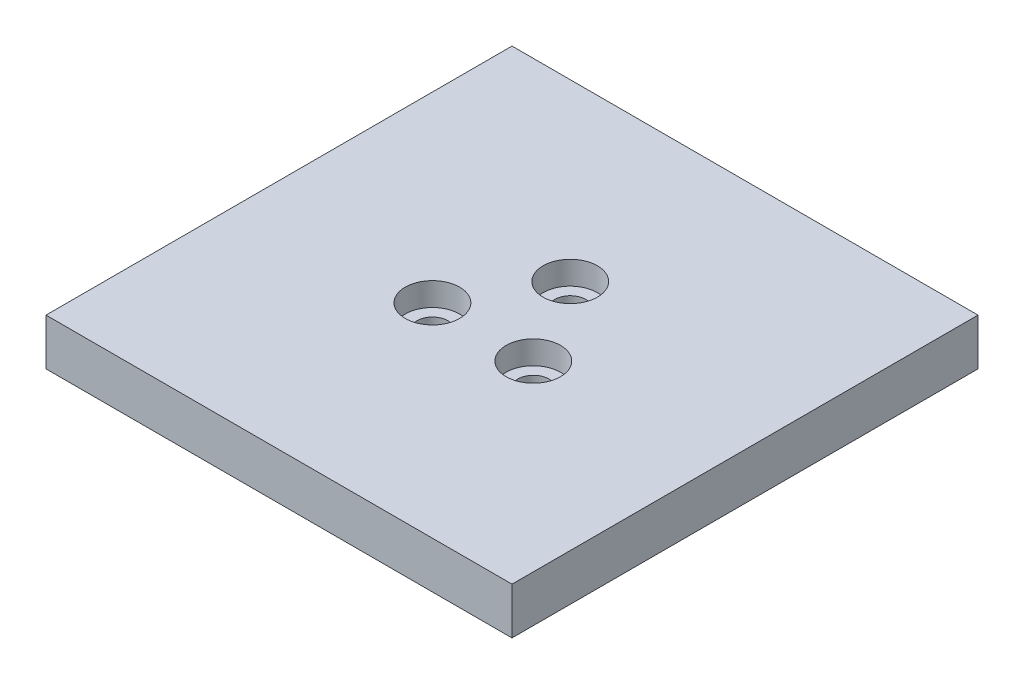
ISO-10303-21;
HEADER;
FILE_DESCRIPTION(('STEP AP214'),'2;1');
FILE_NAME('part.step','',(''),(''),'','','');
FILE_SCHEMA(('AUTOMOTIVE_DESIGN { 1 0 10303 214 1 1 1 1 }'));
ENDSEC;
DATA;
#1=APPLICATION_CONTEXT('core data for automotive mechanical design processes');
#2=APPLICATION_PROTOCOL_DEFINITION('international standard','automotive_design',2000,#1);
#3=PRODUCT_CONTEXT('',#1,'mechanical');
#4=PRODUCT('Part','Part','',(#3));
#5=PRODUCT_RELATED_PRODUCT_CATEGORY('part','',(#4));
#6=PRODUCT_DEFINITION_FORMATION('','',#4);
#7=PRODUCT_DEFINITION_CONTEXT('part definition',#1,'design');
#8=PRODUCT_DEFINITION('design','',#6,#7);
#9=PRODUCT_DEFINITION_SHAPE('','',#8);
#10=(LENGTH_UNIT() NAMED_UNIT(*) SI_UNIT(.MILLI.,.METRE.));
#11=(NAMED_UNIT(*) PLANE_ANGLE_UNIT() SI_UNIT($,.RADIAN.));
#12=(NAMED_UNIT(*) SI_UNIT($,.STERADIAN.) SOLID_ANGLE_UNIT());
#13=UNCERTAINTY_MEASURE_WITH_UNIT(LENGTH_MEASURE(1.E-05),#10,'distance_accuracy_value','');
#14=(GEOMETRIC_REPRESENTATION_CONTEXT(3) GLOBAL_UNCERTAINTY_ASSIGNED_CONTEXT((#13)) GLOBAL_UNIT_ASSIGNED_CONTEXT((#10,
#11,#12)) REPRESENTATION_CONTEXT('',''));
#15=CARTESIAN_POINT('',(0.,0.,0.));
#16=DIRECTION('',(0.,0.,1.));
#17=DIRECTION('',(1.,0.,0.));
#18=AXIS2_PLACEMENT_3D('',#15,#16,#17);
#19=CARTESIAN_POINT('',(-30.,6.,30.));
#20=DIRECTION('',(-1.,0.,0.));
#21=DIRECTION('',(0.,0.,1.));
#22=AXIS2_PLACEMENT_3D('',#19,#20,#21);
#23=PLANE('',#22);
#24=DIRECTION('',(0.,0.,-1.));
#25=VECTOR('',#24,1.);
#26=CARTESIAN_POINT('',(-30.,0.,30.));
#27=LINE('',#26,#25);
#28=CARTESIAN_POINT('',(-30.,0.,30.));
#29=VERTEX_POINT('',#28);
#30=CARTESIAN_POINT('',(-30.,0.,-30.));
#31=VERTEX_POINT('',#30);
#32=EDGE_CURVE('E101',#29,#31,#27,.T.);
#33=ORIENTED_EDGE('',*,*,#32,.F.);
#34=DIRECTION('',(0.,-1.,0.));
#35=VECTOR('',#34,1.);
#36=CARTESIAN_POINT('',(-30.,6.,30.));
#37=LINE('',#36,#35);
#38=CARTESIAN_POINT('',(-30.,6.,30.));
#39=VERTEX_POINT('',#38);
#40=EDGE_CURVE('E11',#39,#29,#37,.T.);
#41=ORIENTED_EDGE('',*,*,#40,.F.);
#42=DIRECTION('',(0.,0.,-1.));
#43=VECTOR('',#42,1.);
#44=CARTESIAN_POINT('',(-30.,6.,30.));
#45=LINE('',#44,#43);
#46=CARTESIAN_POINT('',(-30.,6.,-30.));
#47=VERTEX_POINT('',#46);
#48=EDGE_CURVE('E95',#39,#47,#45,.T.);
#49=ORIENTED_EDGE('',*,*,#48,.T.);
#50=DIRECTION('',(0.,-1.,0.));
#51=VECTOR('',#50,1.);
#52=CARTESIAN_POINT('',(-30.,6.,-30.));
#53=LINE('',#52,#51);
#54=EDGE_CURVE('E74',#47,#31,#53,.T.);
#55=ORIENTED_EDGE('',*,*,#54,.T.);
#56=EDGE_LOOP('',(#33,#41,#49,#55));
#57=FACE_BOUND('',#56,.T.);
#58=ADVANCED_FACE('F33',(#57),#23,.T.);
#59=CARTESIAN_POINT('',(-30.,6.,30.));
#60=DIRECTION('',(0.,0.,-1.));
#61=DIRECTION('',(-1.,0.,0.));
#62=AXIS2_PLACEMENT_3D('',#59,#60,#61);
#63=PLANE('',#62);
#64=DIRECTION('',(1.,0.,0.));
#65=VECTOR('',#64,1.);
#66=CARTESIAN_POINT('',(-30.,0.,30.));
#67=LINE('',#66,#65);
#68=CARTESIAN_POINT('',(30.,0.,30.));
#69=VERTEX_POINT('',#68);
#70=EDGE_CURVE('E66',#29,#69,#67,.T.);
#71=ORIENTED_EDGE('',*,*,#70,.T.);
#72=DIRECTION('',(0.,-1.,0.));
#73=VECTOR('',#72,1.);
#74=CARTESIAN_POINT('',(30.,6.,30.));
#75=LINE('',#74,#73);
#76=CARTESIAN_POINT('',(30.,6.,30.));
#77=VERTEX_POINT('',#76);
#78=EDGE_CURVE('E42',#77,#69,#75,.T.);
#79=ORIENTED_EDGE('',*,*,#78,.F.);
#80=DIRECTION('',(1.,0.,0.));
#81=VECTOR('',#80,1.);
#82=CARTESIAN_POINT('',(-30.,6.,30.));
#83=LINE('',#82,#81);
#84=EDGE_CURVE('E84',#39,#77,#83,.T.);
#85=ORIENTED_EDGE('',*,*,#84,.F.);
#86=ORIENTED_EDGE('',*,*,#40,.T.);
#87=EDGE_LOOP('',(#71,#79,#85,#86));
#88=FACE_BOUND('',#87,.T.);
#89=ADVANCED_FACE('F165',(#88),#63,.F.);
#90=CARTESIAN_POINT('',(30.,6.,30.));
#91=DIRECTION('',(-1.,0.,0.));
#92=DIRECTION('',(0.,0.,1.));
#93=AXIS2_PLACEMENT_3D('',#90,#91,#92);
#94=PLANE('',#93);
#95=DIRECTION('',(0.,0.,-1.));
#96=VECTOR('',#95,1.);
#97=CARTESIAN_POINT('',(30.,0.,30.));
#98=LINE('',#97,#96);
#99=CARTESIAN_POINT('',(30.,0.,-30.));
#100=VERTEX_POINT('',#99);
#101=EDGE_CURVE('E91',#69,#100,#98,.T.);
#102=ORIENTED_EDGE('',*,*,#101,.T.);
#103=DIRECTION('',(0.,-1.,0.));
#104=VECTOR('',#103,1.);
#105=CARTESIAN_POINT('',(30.,6.,-30.));
#106=LINE('',#105,#104);
#107=CARTESIAN_POINT('',(30.,6.,-30.));
#108=VERTEX_POINT('',#107);
#109=EDGE_CURVE('E88',#108,#100,#106,.T.);
#110=ORIENTED_EDGE('',*,*,#109,.F.);
#111=DIRECTION('',(0.,0.,-1.));
#112=VECTOR('',#111,1.);
#113=CARTESIAN_POINT('',(30.,6.,30.));
#114=LINE('',#113,#112);
#115=EDGE_CURVE('E79',#77,#108,#114,.T.);
#116=ORIENTED_EDGE('',*,*,#115,.F.);
#117=ORIENTED_EDGE('',*,*,#78,.T.);
#118=EDGE_LOOP('',(#102,#110,#116,#117));
#119=FACE_BOUND('',#118,.T.);
#120=ADVANCED_FACE('F89',(#119),#94,.F.);
#121=CARTESIAN_POINT('',(-30.,6.,-30.));
#122=DIRECTION('',(0.,0.,-1.));
#123=DIRECTION('',(-1.,0.,0.));
#124=AXIS2_PLACEMENT_3D('',#121,#122,#123);
#125=PLANE('',#124);
#126=DIRECTION('',(1.,0.,0.));
#127=VECTOR('',#126,1.);
#128=CARTESIAN_POINT('',(-30.,0.,-30.));
#129=LINE('',#128,#127);
#130=EDGE_CURVE('E104',#31,#100,#129,.T.);
#131=ORIENTED_EDGE('',*,*,#130,.F.);
#132=ORIENTED_EDGE('',*,*,#54,.F.);
#133=DIRECTION('',(1.,0.,0.));
#134=VECTOR('',#133,1.);
#135=CARTESIAN_POINT('',(-30.,6.,-30.));
#136=LINE('',#135,#134);
#137=EDGE_CURVE('E83',#47,#108,#136,.T.);
#138=ORIENTED_EDGE('',*,*,#137,.T.);
#139=ORIENTED_EDGE('',*,*,#109,.T.);
#140=EDGE_LOOP('',(#131,#132,#138,#139));
#141=FACE_BOUND('',#140,.T.);
#142=ADVANCED_FACE('F94',(#141),#125,.T.);
#143=CARTESIAN_POINT('',(0.,6.,0.));
#144=DIRECTION('',(0.,-1.,0.));
#145=DIRECTION('',(0.,0.,-1.));
#146=AXIS2_PLACEMENT_3D('',#143,#144,#145);
#147=PLANE('',#146);
#148=CARTESIAN_POINT('',(0.,6.,-7.5));
#149=DIRECTION('',(0.,-1.,0.));
#150=DIRECTION('',(0.,0.,-1.));
#151=AXIS2_PLACEMENT_3D('',#148,#149,#150);
#152=CIRCLE('',#151,3.5);
#153=CARTESIAN_POINT('',(0.,6.,-11.));
#154=VERTEX_POINT('',#153);
#155=EDGE_CURVE('E140',#154,#154,#152,.T.);
#156=ORIENTED_EDGE('',*,*,#155,.T.);
#157=EDGE_LOOP('',(#156));
#158=FACE_BOUND('',#157,.T.);
#159=CARTESIAN_POINT('',(6.49519052838328,6.,3.75000000000002));
#160=DIRECTION('',(0.,-1.,0.));
#161=DIRECTION('',(0.,0.,-1.));
#162=AXIS2_PLACEMENT_3D('',#159,#160,#161);
#163=CIRCLE('',#162,3.5);
#164=CARTESIAN_POINT('',(6.49519052838328,6.,0.250000000000024));
#165=VERTEX_POINT('',#164);
#166=EDGE_CURVE('E134',#165,#165,#163,.T.);
#167=ORIENTED_EDGE('',*,*,#166,.T.);
#168=EDGE_LOOP('',(#167));
#169=FACE_BOUND('',#168,.T.);
#170=CARTESIAN_POINT('',(-6.49519052838332,6.,3.74999999999995));
#171=DIRECTION('',(0.,-1.,0.));
#172=DIRECTION('',(0.,0.,-1.));
#173=AXIS2_PLACEMENT_3D('',#170,#171,#172);
#174=CIRCLE('',#173,3.5);
#175=CARTESIAN_POINT('',(-6.49519052838332,6.,0.249999999999949));
#176=VERTEX_POINT('',#175);
#177=EDGE_CURVE('E131',#176,#176,#174,.T.);
#178=ORIENTED_EDGE('',*,*,#177,.T.);
#179=EDGE_LOOP('',(#178));
#180=FACE_BOUND('',#179,.T.);
#181=ORIENTED_EDGE('',*,*,#48,.F.);
#182=ORIENTED_EDGE('',*,*,#84,.T.);
#183=ORIENTED_EDGE('',*,*,#115,.T.);
#184=ORIENTED_EDGE('',*,*,#137,.F.);
#185=EDGE_LOOP('',(#181,#182,#183,#184));
#186=FACE_BOUND('',#185,.T.);
#187=ADVANCED_FACE('F82',(#158,#169,#180,#186),#147,.F.);
#188=CARTESIAN_POINT('',(0.,0.,0.));
#189=DIRECTION('',(0.,-1.,0.));
#190=DIRECTION('',(0.,0.,-1.));
#191=AXIS2_PLACEMENT_3D('',#188,#189,#190);
#192=PLANE('',#191);
#193=CARTESIAN_POINT('',(-6.49519052838271,0.,3.75000000000035));
#194=DIRECTION('',(0.,1.,0.));
#195=DIRECTION('',(0.,0.,1.));
#196=AXIS2_PLACEMENT_3D('',#193,#194,#195);
#197=CIRCLE('',#196,2.);
#198=CARTESIAN_POINT('',(-6.49519052838271,0.,5.75000000000035));
#199=VERTEX_POINT('',#198);
#200=EDGE_CURVE('E105',#199,#199,#197,.T.);
#201=ORIENTED_EDGE('',*,*,#200,.T.);
#202=EDGE_LOOP('',(#201));
#203=FACE_BOUND('',#202,.T.);
#204=CARTESIAN_POINT('',(0.,0.,-7.5));
#205=DIRECTION('',(0.,1.,0.));
#206=DIRECTION('',(0.,0.,1.));
#207=AXIS2_PLACEMENT_3D('',#204,#205,#206);
#208=CIRCLE('',#207,2.);
#209=CARTESIAN_POINT('',(0.,0.,-5.5));
#210=VERTEX_POINT('',#209);
#211=EDGE_CURVE('E123',#210,#210,#208,.T.);
#212=ORIENTED_EDGE('',*,*,#211,.T.);
#213=EDGE_LOOP('',(#212));
#214=FACE_BOUND('',#213,.T.);
#215=CARTESIAN_POINT('',(6.49519052838388,0.,3.74999999999966));
#216=DIRECTION('',(0.,1.,0.));
#217=DIRECTION('',(0.,0.,1.));
#218=AXIS2_PLACEMENT_3D('',#215,#216,#217);
#219=CIRCLE('',#218,2.);
#220=CARTESIAN_POINT('',(6.49519052838388,0.,5.74999999999966));
#221=VERTEX_POINT('',#220);
#222=EDGE_CURVE('E119',#221,#221,#219,.T.);
#223=ORIENTED_EDGE('',*,*,#222,.T.);
#224=EDGE_LOOP('',(#223));
#225=FACE_BOUND('',#224,.T.);
#226=ORIENTED_EDGE('',*,*,#32,.T.);
#227=ORIENTED_EDGE('',*,*,#130,.T.);
#228=ORIENTED_EDGE('',*,*,#101,.F.);
#229=ORIENTED_EDGE('',*,*,#70,.F.);
#230=EDGE_LOOP('',(#226,#227,#228,#229));
#231=FACE_BOUND('',#230,.T.);
#232=ADVANCED_FACE('F171',(#203,#214,#225,#231),#192,.T.);
#233=CARTESIAN_POINT('',(6.49519052838388,6.,3.74999999999966));
#234=DIRECTION('',(0.,-1.,0.));
#235=DIRECTION('',(0.,0.,-1.));
#236=AXIS2_PLACEMENT_3D('',#233,#234,#235);
#237=CYLINDRICAL_SURFACE('',#236,2.);
#238=CARTESIAN_POINT('',(6.49519052838388,3.,3.74999999999966));
#239=DIRECTION('',(0.,-1.,0.));
#240=DIRECTION('',(0.,0.,-1.));
#241=AXIS2_PLACEMENT_3D('',#238,#239,#240);
#242=CIRCLE('',#241,2.);
#243=CARTESIAN_POINT('',(6.49519052838388,3.,1.74999999999966));
#244=VERTEX_POINT('',#243);
#245=EDGE_CURVE('E36',#244,#244,#242,.T.);
#246=ORIENTED_EDGE('',*,*,#245,.F.);
#247=EDGE_LOOP('',(#246));
#248=FACE_BOUND('',#247,.T.);
#249=ORIENTED_EDGE('',*,*,#222,.F.);
#250=EDGE_LOOP('',(#249));
#251=FACE_BOUND('',#250,.T.);
#252=ADVANCED_FACE('F173',(#248,#251),#237,.F.);
#253=CARTESIAN_POINT('',(0.,6.,-7.5));
#254=DIRECTION('',(0.,-1.,0.));
#255=DIRECTION('',(0.,0.,-1.));
#256=AXIS2_PLACEMENT_3D('',#253,#254,#255);
#257=CYLINDRICAL_SURFACE('',#256,2.);
#258=CARTESIAN_POINT('',(0.,3.,-7.5));
#259=DIRECTION('',(0.,-1.,0.));
#260=DIRECTION('',(0.,0.,-1.));
#261=AXIS2_PLACEMENT_3D('',#258,#259,#260);
#262=CIRCLE('',#261,2.);
#263=CARTESIAN_POINT('',(0.,3.,-9.5));
#264=VERTEX_POINT('',#263);
#265=EDGE_CURVE('E113',#264,#264,#262,.T.);
#266=ORIENTED_EDGE('',*,*,#265,.F.);
#267=EDGE_LOOP('',(#266));
#268=FACE_BOUND('',#267,.T.);
#269=ORIENTED_EDGE('',*,*,#211,.F.);
#270=EDGE_LOOP('',(#269));
#271=FACE_BOUND('',#270,.T.);
#272=ADVANCED_FACE('F180',(#268,#271),#257,.F.);
#273=CARTESIAN_POINT('',(-6.49519052838271,6.,3.75000000000035));
#274=DIRECTION('',(0.,-1.,0.));
#275=DIRECTION('',(0.,0.,-1.));
#276=AXIS2_PLACEMENT_3D('',#273,#274,#275);
#277=CYLINDRICAL_SURFACE('',#276,2.);
#278=CARTESIAN_POINT('',(-6.49519052838271,3.,3.75000000000035));
#279=DIRECTION('',(0.,-1.,0.));
#280=DIRECTION('',(0.,0.,-1.));
#281=AXIS2_PLACEMENT_3D('',#278,#279,#280);
#282=CIRCLE('',#281,2.);
#283=CARTESIAN_POINT('',(-6.49519052838271,3.,1.75000000000035));
#284=VERTEX_POINT('',#283);
#285=EDGE_CURVE('E111',#284,#284,#282,.T.);
#286=ORIENTED_EDGE('',*,*,#285,.F.);
#287=EDGE_LOOP('',(#286));
#288=FACE_BOUND('',#287,.T.);
#289=ORIENTED_EDGE('',*,*,#200,.F.);
#290=EDGE_LOOP('',(#289));
#291=FACE_BOUND('',#290,.T.);
#292=ADVANCED_FACE('F214',(#288,#291),#277,.F.);
#293=CARTESIAN_POINT('',(-6.49519052838332,3.,3.74999999999995));
#294=DIRECTION('',(0.,1.,0.));
#295=DIRECTION('',(0.,0.,1.));
#296=AXIS2_PLACEMENT_3D('',#293,#294,#295);
#297=CYLINDRICAL_SURFACE('',#296,3.5);
#298=CARTESIAN_POINT('',(-6.49519052838332,3.,3.74999999999995));
#299=DIRECTION('',(0.,-1.,0.));
#300=DIRECTION('',(0.,0.,-1.));
#301=AXIS2_PLACEMENT_3D('',#298,#299,#300);
#302=CIRCLE('',#301,3.5);
#303=CARTESIAN_POINT('',(-6.49519052838332,3.,0.249999999999949));
#304=VERTEX_POINT('',#303);
#305=EDGE_CURVE('E114',#304,#304,#302,.T.);
#306=ORIENTED_EDGE('',*,*,#305,.T.);
#307=EDGE_LOOP('',(#306));
#308=FACE_BOUND('',#307,.T.);
#309=ORIENTED_EDGE('',*,*,#177,.F.);
#310=EDGE_LOOP('',(#309));
#311=FACE_BOUND('',#310,.T.);
#312=ADVANCED_FACE('F224',(#308,#311),#297,.F.);
#313=CARTESIAN_POINT('',(-6.49519052838332,3.,3.74999999999995));
#314=DIRECTION('',(0.,-1.,0.));
#315=DIRECTION('',(0.,0.,-1.));
#316=AXIS2_PLACEMENT_3D('',#313,#314,#315);
#317=PLANE('',#316);
#318=ORIENTED_EDGE('',*,*,#285,.T.);
#319=EDGE_LOOP('',(#318));
#320=FACE_BOUND('',#319,.T.);
#321=ORIENTED_EDGE('',*,*,#305,.F.);
#322=EDGE_LOOP('',(#321));
#323=FACE_BOUND('',#322,.T.);
#324=ADVANCED_FACE('F234',(#320,#323),#317,.F.);
#325=CARTESIAN_POINT('',(0.,3.,-7.5));
#326=DIRECTION('',(0.,1.,0.));
#327=DIRECTION('',(0.,0.,1.));
#328=AXIS2_PLACEMENT_3D('',#325,#326,#327);
#329=CYLINDRICAL_SURFACE('',#328,3.5);
#330=CARTESIAN_POINT('',(0.,3.,-7.5));
#331=DIRECTION('',(0.,-1.,0.));
#332=DIRECTION('',(0.,0.,-1.));
#333=AXIS2_PLACEMENT_3D('',#330,#331,#332);
#334=CIRCLE('',#333,3.5);
#335=CARTESIAN_POINT('',(0.,3.,-11.));
#336=VERTEX_POINT('',#335);
#337=EDGE_CURVE('E137',#336,#336,#334,.T.);
#338=ORIENTED_EDGE('',*,*,#337,.T.);
#339=EDGE_LOOP('',(#338));
#340=FACE_BOUND('',#339,.T.);
#341=ORIENTED_EDGE('',*,*,#155,.F.);
#342=EDGE_LOOP('',(#341));
#343=FACE_BOUND('',#342,.T.);
#344=ADVANCED_FACE('F162',(#340,#343),#329,.F.);
#345=CARTESIAN_POINT('',(0.,3.,-7.5));
#346=DIRECTION('',(0.,-1.,0.));
#347=DIRECTION('',(0.,0.,-1.));
#348=AXIS2_PLACEMENT_3D('',#345,#346,#347);
#349=PLANE('',#348);
#350=ORIENTED_EDGE('',*,*,#265,.T.);
#351=EDGE_LOOP('',(#350));
#352=FACE_BOUND('',#351,.T.);
#353=ORIENTED_EDGE('',*,*,#337,.F.);
#354=EDGE_LOOP('',(#353));
#355=FACE_BOUND('',#354,.T.);
#356=ADVANCED_FACE('F154',(#352,#355),#349,.F.);
#357=CARTESIAN_POINT('',(6.49519052838328,3.,3.75000000000002));
#358=DIRECTION('',(0.,1.,0.));
#359=DIRECTION('',(0.,0.,1.));
#360=AXIS2_PLACEMENT_3D('',#357,#358,#359);
#361=CYLINDRICAL_SURFACE('',#360,3.5);
#362=CARTESIAN_POINT('',(6.49519052838328,3.,3.75000000000002));
#363=DIRECTION('',(0.,-1.,0.));
#364=DIRECTION('',(0.,0.,-1.));
#365=AXIS2_PLACEMENT_3D('',#362,#363,#364);
#366=CIRCLE('',#365,3.5);
#367=CARTESIAN_POINT('',(6.49519052838328,3.,0.250000000000024));
#368=VERTEX_POINT('',#367);
#369=EDGE_CURVE('E143',#368,#368,#366,.T.);
#370=ORIENTED_EDGE('',*,*,#369,.T.);
#371=EDGE_LOOP('',(#370));
#372=FACE_BOUND('',#371,.T.);
#373=ORIENTED_EDGE('',*,*,#166,.F.);
#374=EDGE_LOOP('',(#373));
#375=FACE_BOUND('',#374,.T.);
#376=ADVANCED_FACE('F151',(#372,#375),#361,.F.);
#377=CARTESIAN_POINT('',(6.49519052838328,3.,3.75000000000002));
#378=DIRECTION('',(0.,-1.,0.));
#379=DIRECTION('',(0.,0.,-1.));
#380=AXIS2_PLACEMENT_3D('',#377,#378,#379);
#381=PLANE('',#380);
#382=ORIENTED_EDGE('',*,*,#245,.T.);
#383=EDGE_LOOP('',(#382));
#384=FACE_BOUND('',#383,.T.);
#385=ORIENTED_EDGE('',*,*,#369,.F.);
#386=EDGE_LOOP('',(#385));
#387=FACE_BOUND('',#386,.T.);
#388=ADVANCED_FACE('F153',(#384,#387),#381,.F.);
#389=CLOSED_SHELL('',(#58,#89,#120,#142,#187,#232,#252,#272,#292,#312,#324,#344,#356,#376,#388));
#390=MANIFOLD_SOLID_BREP('B2',#389);
#391=ADVANCED_BREP_SHAPE_REPRESENTATION('',(#18,#390),#14);
#392=SHAPE_DEFINITION_REPRESENTATION(#9,#391);
ENDSEC;
END-ISO-10303-21;
